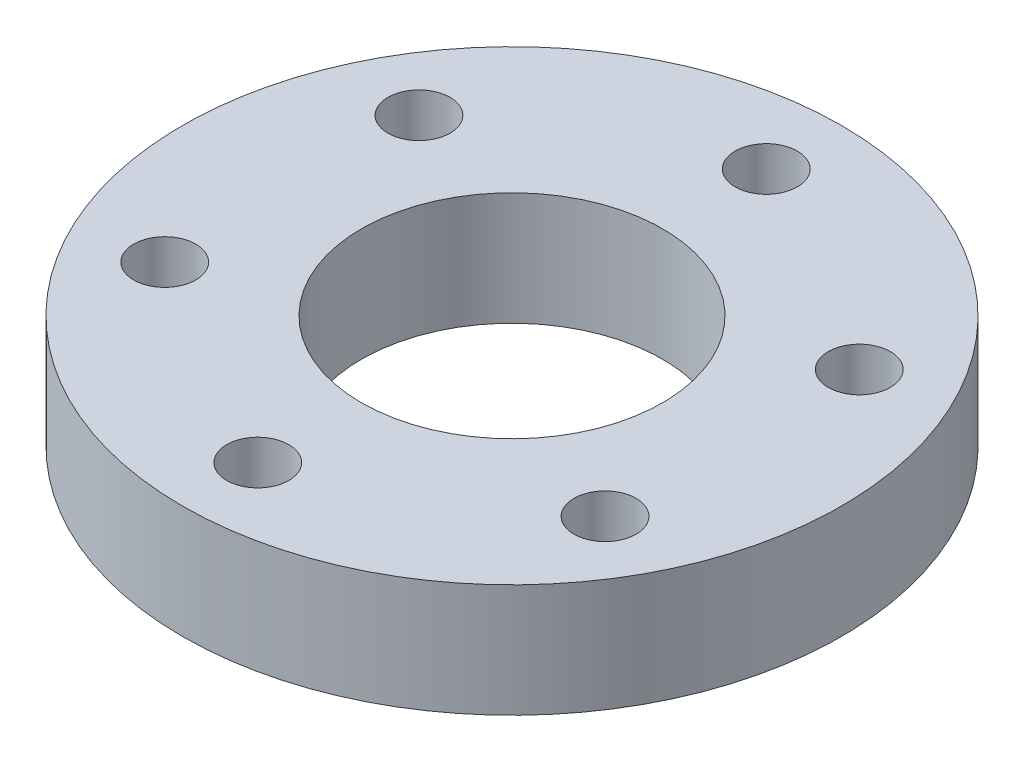
ISO-10303-21;
HEADER;
FILE_DESCRIPTION(('STEP AP214'),'2;1');
FILE_NAME('part.step','',(''),(''),'','','');
FILE_SCHEMA(('AUTOMOTIVE_DESIGN { 1 0 10303 214 1 1 1 1 }'));
ENDSEC;
DATA;
#1=APPLICATION_CONTEXT('core data for automotive mechanical design processes');
#2=APPLICATION_PROTOCOL_DEFINITION('international standard','automotive_design',2000,#1);
#3=PRODUCT_CONTEXT('',#1,'mechanical');
#4=PRODUCT('Part','Part','',(#3));
#5=PRODUCT_RELATED_PRODUCT_CATEGORY('part','',(#4));
#6=PRODUCT_DEFINITION_FORMATION('','',#4);
#7=PRODUCT_DEFINITION_CONTEXT('part definition',#1,'design');
#8=PRODUCT_DEFINITION('design','',#6,#7);
#9=PRODUCT_DEFINITION_SHAPE('','',#8);
#10=(LENGTH_UNIT() NAMED_UNIT(*) SI_UNIT(.MILLI.,.METRE.));
#11=(NAMED_UNIT(*) PLANE_ANGLE_UNIT() SI_UNIT($,.RADIAN.));
#12=(NAMED_UNIT(*) SI_UNIT($,.STERADIAN.) SOLID_ANGLE_UNIT());
#13=UNCERTAINTY_MEASURE_WITH_UNIT(LENGTH_MEASURE(1.E-05),#10,'distance_accuracy_value','');
#14=(GEOMETRIC_REPRESENTATION_CONTEXT(3) GLOBAL_UNCERTAINTY_ASSIGNED_CONTEXT((#13)) GLOBAL_UNIT_ASSIGNED_CONTEXT((#10,
#11,#12)) REPRESENTATION_CONTEXT('',''));
#15=CARTESIAN_POINT('',(0.,0.,0.));
#16=DIRECTION('',(0.,0.,1.));
#17=DIRECTION('',(1.,0.,0.));
#18=AXIS2_PLACEMENT_3D('',#15,#16,#17);
#19=CARTESIAN_POINT('',(0.,6.,0.));
#20=DIRECTION('',(0.,1.,0.));
#21=DIRECTION('',(0.,0.,1.));
#22=AXIS2_PLACEMENT_3D('',#19,#20,#21);
#23=PLANE('',#22);
#24=CARTESIAN_POINT('',(-11.6913429510899,6.,6.75000000000001));
#25=DIRECTION('',(0.,1.,0.));
#26=DIRECTION('',(0.,0.,1.));
#27=AXIS2_PLACEMENT_3D('',#24,#25,#26);
#28=CIRCLE('',#27,1.65);
#29=CARTESIAN_POINT('',(-11.6913429510899,6.,8.40000000000001));
#30=VERTEX_POINT('',#29);
#31=EDGE_CURVE('E77',#30,#30,#28,.T.);
#32=ORIENTED_EDGE('',*,*,#31,.F.);
#33=EDGE_LOOP('',(#32));
#34=FACE_BOUND('',#33,.T.);
#35=CARTESIAN_POINT('',(11.6913429510899,6.,6.75));
#36=DIRECTION('',(0.,1.,0.));
#37=DIRECTION('',(0.,0.,1.));
#38=AXIS2_PLACEMENT_3D('',#35,#36,#37);
#39=CIRCLE('',#38,1.65);
#40=CARTESIAN_POINT('',(11.6913429510899,6.,8.4));
#41=VERTEX_POINT('',#40);
#42=EDGE_CURVE('E65',#41,#41,#39,.T.);
#43=ORIENTED_EDGE('',*,*,#42,.F.);
#44=EDGE_LOOP('',(#43));
#45=FACE_BOUND('',#44,.T.);
#46=CARTESIAN_POINT('',(0.,6.,-13.5));
#47=DIRECTION('',(0.,1.,0.));
#48=DIRECTION('',(0.,0.,1.));
#49=AXIS2_PLACEMENT_3D('',#46,#47,#48);
#50=CIRCLE('',#49,1.65);
#51=CARTESIAN_POINT('',(0.,6.,-11.85));
#52=VERTEX_POINT('',#51);
#53=EDGE_CURVE('E53',#52,#52,#50,.T.);
#54=ORIENTED_EDGE('',*,*,#53,.F.);
#55=EDGE_LOOP('',(#54));
#56=FACE_BOUND('',#55,.T.);
#57=CARTESIAN_POINT('',(0.,6.,0.));
#58=DIRECTION('',(0.,1.,0.));
#59=DIRECTION('',(0.,0.,1.));
#60=AXIS2_PLACEMENT_3D('',#57,#58,#59);
#61=CIRCLE('',#60,17.5);
#62=CARTESIAN_POINT('',(0.,6.,17.5));
#63=VERTEX_POINT('',#62);
#64=EDGE_CURVE('E10',#63,#63,#61,.T.);
#65=ORIENTED_EDGE('',*,*,#64,.T.);
#66=EDGE_LOOP('',(#65));
#67=FACE_BOUND('',#66,.T.);
#68=CARTESIAN_POINT('',(0.,6.,0.));
#69=DIRECTION('',(0.,1.,0.));
#70=DIRECTION('',(0.,0.,1.));
#71=AXIS2_PLACEMENT_3D('',#68,#69,#70);
#72=CIRCLE('',#71,8.);
#73=CARTESIAN_POINT('',(0.,6.,8.));
#74=VERTEX_POINT('',#73);
#75=EDGE_CURVE('E48',#74,#74,#72,.T.);
#76=ORIENTED_EDGE('',*,*,#75,.F.);
#77=EDGE_LOOP('',(#76));
#78=FACE_BOUND('',#77,.T.);
#79=CARTESIAN_POINT('',(11.6913429510899,6.,-6.75));
#80=DIRECTION('',(0.,1.,0.));
#81=DIRECTION('',(0.,0.,1.));
#82=AXIS2_PLACEMENT_3D('',#79,#80,#81);
#83=CIRCLE('',#82,1.65);
#84=CARTESIAN_POINT('',(11.6913429510899,6.,-5.1));
#85=VERTEX_POINT('',#84);
#86=EDGE_CURVE('E59',#85,#85,#83,.T.);
#87=ORIENTED_EDGE('',*,*,#86,.F.);
#88=EDGE_LOOP('',(#87));
#89=FACE_BOUND('',#88,.T.);
#90=CARTESIAN_POINT('',(0.,6.,13.5));
#91=DIRECTION('',(0.,1.,0.));
#92=DIRECTION('',(0.,0.,1.));
#93=AXIS2_PLACEMENT_3D('',#90,#91,#92);
#94=CIRCLE('',#93,1.65);
#95=CARTESIAN_POINT('',(0.,6.,15.15));
#96=VERTEX_POINT('',#95);
#97=EDGE_CURVE('E71',#96,#96,#94,.T.);
#98=ORIENTED_EDGE('',*,*,#97,.F.);
#99=EDGE_LOOP('',(#98));
#100=FACE_BOUND('',#99,.T.);
#101=CARTESIAN_POINT('',(-11.6913429510899,6.,-6.74999999999999));
#102=DIRECTION('',(0.,1.,0.));
#103=DIRECTION('',(0.,0.,1.));
#104=AXIS2_PLACEMENT_3D('',#101,#102,#103);
#105=CIRCLE('',#104,1.65);
#106=CARTESIAN_POINT('',(-11.6913429510899,6.,-5.09999999999999));
#107=VERTEX_POINT('',#106);
#108=EDGE_CURVE('E83',#107,#107,#105,.T.);
#109=ORIENTED_EDGE('',*,*,#108,.F.);
#110=EDGE_LOOP('',(#109));
#111=FACE_BOUND('',#110,.T.);
#112=ADVANCED_FACE('F37',(#34,#45,#56,#67,#78,#89,#100,#111),#23,.T.);
#113=CARTESIAN_POINT('',(0.,0.,0.));
#114=DIRECTION('',(0.,1.,0.));
#115=DIRECTION('',(0.,0.,1.));
#116=AXIS2_PLACEMENT_3D('',#113,#114,#115);
#117=PLANE('',#116);
#118=CARTESIAN_POINT('',(0.,0.,0.));
#119=DIRECTION('',(0.,1.,0.));
#120=DIRECTION('',(0.,0.,1.));
#121=AXIS2_PLACEMENT_3D('',#118,#119,#120);
#122=CIRCLE('',#121,17.5);
#123=CARTESIAN_POINT('',(0.,0.,17.5));
#124=VERTEX_POINT('',#123);
#125=EDGE_CURVE('E41',#124,#124,#122,.T.);
#126=ORIENTED_EDGE('',*,*,#125,.F.);
#127=EDGE_LOOP('',(#126));
#128=FACE_BOUND('',#127,.T.);
#129=CARTESIAN_POINT('',(0.,0.,0.));
#130=DIRECTION('',(0.,1.,0.));
#131=DIRECTION('',(0.,0.,1.));
#132=AXIS2_PLACEMENT_3D('',#129,#130,#131);
#133=CIRCLE('',#132,8.);
#134=CARTESIAN_POINT('',(0.,0.,8.));
#135=VERTEX_POINT('',#134);
#136=EDGE_CURVE('E50',#135,#135,#133,.T.);
#137=ORIENTED_EDGE('',*,*,#136,.T.);
#138=EDGE_LOOP('',(#137));
#139=FACE_BOUND('',#138,.T.);
#140=CARTESIAN_POINT('',(0.,0.,-13.5));
#141=DIRECTION('',(0.,1.,0.));
#142=DIRECTION('',(0.,0.,1.));
#143=AXIS2_PLACEMENT_3D('',#140,#141,#142);
#144=CIRCLE('',#143,1.65);
#145=CARTESIAN_POINT('',(0.,0.,-11.85));
#146=VERTEX_POINT('',#145);
#147=EDGE_CURVE('E56',#146,#146,#144,.T.);
#148=ORIENTED_EDGE('',*,*,#147,.T.);
#149=EDGE_LOOP('',(#148));
#150=FACE_BOUND('',#149,.T.);
#151=CARTESIAN_POINT('',(11.6913429510899,0.,-6.75));
#152=DIRECTION('',(0.,1.,0.));
#153=DIRECTION('',(0.,0.,1.));
#154=AXIS2_PLACEMENT_3D('',#151,#152,#153);
#155=CIRCLE('',#154,1.65);
#156=CARTESIAN_POINT('',(11.6913429510899,0.,-5.1));
#157=VERTEX_POINT('',#156);
#158=EDGE_CURVE('E62',#157,#157,#155,.T.);
#159=ORIENTED_EDGE('',*,*,#158,.T.);
#160=EDGE_LOOP('',(#159));
#161=FACE_BOUND('',#160,.T.);
#162=CARTESIAN_POINT('',(11.6913429510899,0.,6.75));
#163=DIRECTION('',(0.,1.,0.));
#164=DIRECTION('',(0.,0.,1.));
#165=AXIS2_PLACEMENT_3D('',#162,#163,#164);
#166=CIRCLE('',#165,1.65);
#167=CARTESIAN_POINT('',(11.6913429510899,0.,8.4));
#168=VERTEX_POINT('',#167);
#169=EDGE_CURVE('E68',#168,#168,#166,.T.);
#170=ORIENTED_EDGE('',*,*,#169,.T.);
#171=EDGE_LOOP('',(#170));
#172=FACE_BOUND('',#171,.T.);
#173=CARTESIAN_POINT('',(0.,0.,13.5));
#174=DIRECTION('',(0.,1.,0.));
#175=DIRECTION('',(0.,0.,1.));
#176=AXIS2_PLACEMENT_3D('',#173,#174,#175);
#177=CIRCLE('',#176,1.65);
#178=CARTESIAN_POINT('',(0.,0.,15.15));
#179=VERTEX_POINT('',#178);
#180=EDGE_CURVE('E74',#179,#179,#177,.T.);
#181=ORIENTED_EDGE('',*,*,#180,.T.);
#182=EDGE_LOOP('',(#181));
#183=FACE_BOUND('',#182,.T.);
#184=CARTESIAN_POINT('',(-11.6913429510899,0.,6.75000000000001));
#185=DIRECTION('',(0.,1.,0.));
#186=DIRECTION('',(0.,0.,1.));
#187=AXIS2_PLACEMENT_3D('',#184,#185,#186);
#188=CIRCLE('',#187,1.65);
#189=CARTESIAN_POINT('',(-11.6913429510899,0.,8.40000000000001));
#190=VERTEX_POINT('',#189);
#191=EDGE_CURVE('E80',#190,#190,#188,.T.);
#192=ORIENTED_EDGE('',*,*,#191,.T.);
#193=EDGE_LOOP('',(#192));
#194=FACE_BOUND('',#193,.T.);
#195=CARTESIAN_POINT('',(-11.6913429510899,0.,-6.74999999999999));
#196=DIRECTION('',(0.,1.,0.));
#197=DIRECTION('',(0.,0.,1.));
#198=AXIS2_PLACEMENT_3D('',#195,#196,#197);
#199=CIRCLE('',#198,1.65);
#200=CARTESIAN_POINT('',(-11.6913429510899,0.,-5.09999999999999));
#201=VERTEX_POINT('',#200);
#202=EDGE_CURVE('E86',#201,#201,#199,.T.);
#203=ORIENTED_EDGE('',*,*,#202,.T.);
#204=EDGE_LOOP('',(#203));
#205=FACE_BOUND('',#204,.T.);
#206=ADVANCED_FACE('F96',(#128,#139,#150,#161,#172,#183,#194,#205),#117,.F.);
#207=CARTESIAN_POINT('',(0.,6.,0.));
#208=DIRECTION('',(0.,-1.,0.));
#209=DIRECTION('',(0.,0.,-1.));
#210=AXIS2_PLACEMENT_3D('',#207,#208,#209);
#211=CYLINDRICAL_SURFACE('',#210,17.5);
#212=ORIENTED_EDGE('',*,*,#64,.F.);
#213=EDGE_LOOP('',(#212));
#214=FACE_BOUND('',#213,.T.);
#215=ORIENTED_EDGE('',*,*,#125,.T.);
#216=EDGE_LOOP('',(#215));
#217=FACE_BOUND('',#216,.T.);
#218=ADVANCED_FACE('F39',(#214,#217),#211,.T.);
#219=CARTESIAN_POINT('',(0.,6.,0.));
#220=DIRECTION('',(0.,-1.,0.));
#221=DIRECTION('',(0.,0.,-1.));
#222=AXIS2_PLACEMENT_3D('',#219,#220,#221);
#223=CYLINDRICAL_SURFACE('',#222,8.);
#224=ORIENTED_EDGE('',*,*,#75,.T.);
#225=EDGE_LOOP('',(#224));
#226=FACE_BOUND('',#225,.T.);
#227=ORIENTED_EDGE('',*,*,#136,.F.);
#228=EDGE_LOOP('',(#227));
#229=FACE_BOUND('',#228,.T.);
#230=ADVANCED_FACE('F106',(#226,#229),#223,.F.);
#231=CARTESIAN_POINT('',(0.,6.,-13.5));
#232=DIRECTION('',(0.,-1.,0.));
#233=DIRECTION('',(0.,0.,-1.));
#234=AXIS2_PLACEMENT_3D('',#231,#232,#233);
#235=CYLINDRICAL_SURFACE('',#234,1.65);
#236=ORIENTED_EDGE('',*,*,#53,.T.);
#237=EDGE_LOOP('',(#236));
#238=FACE_BOUND('',#237,.T.);
#239=ORIENTED_EDGE('',*,*,#147,.F.);
#240=EDGE_LOOP('',(#239));
#241=FACE_BOUND('',#240,.T.);
#242=ADVANCED_FACE('F109',(#238,#241),#235,.F.);
#243=CARTESIAN_POINT('',(11.6913429510899,6.,-6.75));
#244=DIRECTION('',(0.,-1.,0.));
#245=DIRECTION('',(0.,0.,-1.));
#246=AXIS2_PLACEMENT_3D('',#243,#244,#245);
#247=CYLINDRICAL_SURFACE('',#246,1.65);
#248=ORIENTED_EDGE('',*,*,#86,.T.);
#249=EDGE_LOOP('',(#248));
#250=FACE_BOUND('',#249,.T.);
#251=ORIENTED_EDGE('',*,*,#158,.F.);
#252=EDGE_LOOP('',(#251));
#253=FACE_BOUND('',#252,.T.);
#254=ADVANCED_FACE('F113',(#250,#253),#247,.F.);
#255=CARTESIAN_POINT('',(11.6913429510899,6.,6.75));
#256=DIRECTION('',(0.,-1.,0.));
#257=DIRECTION('',(0.,0.,-1.));
#258=AXIS2_PLACEMENT_3D('',#255,#256,#257);
#259=CYLINDRICAL_SURFACE('',#258,1.65);
#260=ORIENTED_EDGE('',*,*,#42,.T.);
#261=EDGE_LOOP('',(#260));
#262=FACE_BOUND('',#261,.T.);
#263=ORIENTED_EDGE('',*,*,#169,.F.);
#264=EDGE_LOOP('',(#263));
#265=FACE_BOUND('',#264,.T.);
#266=ADVANCED_FACE('F117',(#262,#265),#259,.F.);
#267=CARTESIAN_POINT('',(0.,6.,13.5));
#268=DIRECTION('',(0.,-1.,0.));
#269=DIRECTION('',(0.,0.,-1.));
#270=AXIS2_PLACEMENT_3D('',#267,#268,#269);
#271=CYLINDRICAL_SURFACE('',#270,1.65);
#272=ORIENTED_EDGE('',*,*,#97,.T.);
#273=EDGE_LOOP('',(#272));
#274=FACE_BOUND('',#273,.T.);
#275=ORIENTED_EDGE('',*,*,#180,.F.);
#276=EDGE_LOOP('',(#275));
#277=FACE_BOUND('',#276,.T.);
#278=ADVANCED_FACE('F121',(#274,#277),#271,.F.);
#279=CARTESIAN_POINT('',(-11.6913429510899,6.,6.75000000000001));
#280=DIRECTION('',(0.,-1.,0.));
#281=DIRECTION('',(0.,0.,-1.));
#282=AXIS2_PLACEMENT_3D('',#279,#280,#281);
#283=CYLINDRICAL_SURFACE('',#282,1.65);
#284=ORIENTED_EDGE('',*,*,#31,.T.);
#285=EDGE_LOOP('',(#284));
#286=FACE_BOUND('',#285,.T.);
#287=ORIENTED_EDGE('',*,*,#191,.F.);
#288=EDGE_LOOP('',(#287));
#289=FACE_BOUND('',#288,.T.);
#290=ADVANCED_FACE('F125',(#286,#289),#283,.F.);
#291=CARTESIAN_POINT('',(-11.6913429510899,6.,-6.74999999999999));
#292=DIRECTION('',(0.,-1.,0.));
#293=DIRECTION('',(0.,0.,-1.));
#294=AXIS2_PLACEMENT_3D('',#291,#292,#293);
#295=CYLINDRICAL_SURFACE('',#294,1.65);
#296=ORIENTED_EDGE('',*,*,#108,.T.);
#297=EDGE_LOOP('',(#296));
#298=FACE_BOUND('',#297,.T.);
#299=ORIENTED_EDGE('',*,*,#202,.F.);
#300=EDGE_LOOP('',(#299));
#301=FACE_BOUND('',#300,.T.);
#302=ADVANCED_FACE('F92',(#298,#301),#295,.F.);
#303=CLOSED_SHELL('',(#112,#206,#218,#230,#242,#254,#266,#278,#290,#302));
#304=MANIFOLD_SOLID_BREP('B2',#303);
#305=ADVANCED_BREP_SHAPE_REPRESENTATION('',(#18,#304),#14);
#306=SHAPE_DEFINITION_REPRESENTATION(#9,#305);
ENDSEC;
END-ISO-10303-21;
